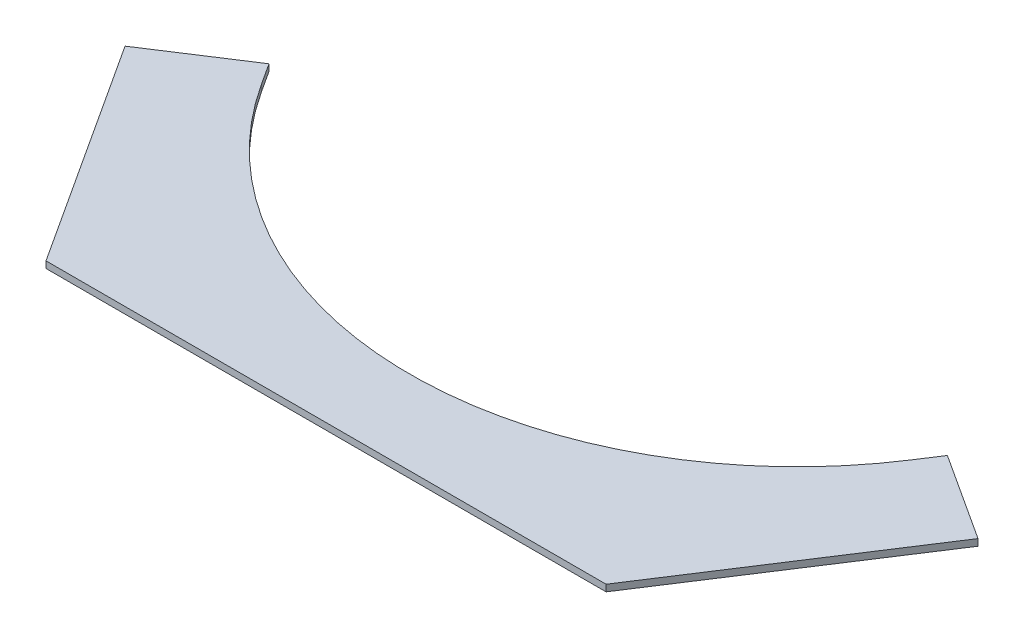
ISO-10303-21;
HEADER;
FILE_DESCRIPTION(('STEP AP214'),'2;1');
FILE_NAME('part.step','',(''),(''),'','','');
FILE_SCHEMA(('AUTOMOTIVE_DESIGN { 1 0 10303 214 1 1 1 1 }'));
ENDSEC;
DATA;
#1=APPLICATION_CONTEXT('core data for automotive mechanical design processes');
#2=APPLICATION_PROTOCOL_DEFINITION('international standard','automotive_design',2000,#1);
#3=PRODUCT_CONTEXT('',#1,'mechanical');
#4=PRODUCT('Part','Part','',(#3));
#5=PRODUCT_RELATED_PRODUCT_CATEGORY('part','',(#4));
#6=PRODUCT_DEFINITION_FORMATION('','',#4);
#7=PRODUCT_DEFINITION_CONTEXT('part definition',#1,'design');
#8=PRODUCT_DEFINITION('design','',#6,#7);
#9=PRODUCT_DEFINITION_SHAPE('','',#8);
#10=(LENGTH_UNIT() NAMED_UNIT(*) SI_UNIT(.MILLI.,.METRE.));
#11=(NAMED_UNIT(*) PLANE_ANGLE_UNIT() SI_UNIT($,.RADIAN.));
#12=(NAMED_UNIT(*) SI_UNIT($,.STERADIAN.) SOLID_ANGLE_UNIT());
#13=UNCERTAINTY_MEASURE_WITH_UNIT(LENGTH_MEASURE(1.E-05),#10,'distance_accuracy_value','');
#14=(GEOMETRIC_REPRESENTATION_CONTEXT(3) GLOBAL_UNCERTAINTY_ASSIGNED_CONTEXT((#13)) GLOBAL_UNIT_ASSIGNED_CONTEXT((#10,
#11,#12)) REPRESENTATION_CONTEXT('',''));
#15=CARTESIAN_POINT('',(0.,0.,0.));
#16=DIRECTION('',(0.,0.,1.));
#17=DIRECTION('',(1.,0.,0.));
#18=AXIS2_PLACEMENT_3D('',#15,#16,#17);
#19=CARTESIAN_POINT('',(-139.851376596993,6.35,-215.352234962946));
#20=DIRECTION('',(0.838670567945421,0.,-0.544639035015032));
#21=DIRECTION('',(-0.544639035015032,0.,-0.838670567945421));
#22=AXIS2_PLACEMENT_3D('',#19,#20,#21);
#23=PLANE('',#22);
#24=DIRECTION('',(0.544639035015032,0.,0.838670567945421));
#25=VECTOR('',#24,1.);
#26=CARTESIAN_POINT('',(-139.851376596993,0.,-215.352234962946));
#27=LINE('',#26,#25);
#28=CARTESIAN_POINT('',(-139.851376596993,0.,-215.352234962946));
#29=VERTEX_POINT('',#28);
#30=CARTESIAN_POINT('',(0.,0.,0.));
#31=VERTEX_POINT('',#30);
#32=EDGE_CURVE('E129',#29,#31,#27,.T.);
#33=ORIENTED_EDGE('',*,*,#32,.T.);
#34=DIRECTION('',(0.,-1.,0.));
#35=VECTOR('',#34,1.);
#36=CARTESIAN_POINT('',(0.,6.35,0.));
#37=LINE('',#36,#35);
#38=CARTESIAN_POINT('',(0.,6.35,0.));
#39=VERTEX_POINT('',#38);
#40=EDGE_CURVE('E11',#39,#31,#37,.T.);
#41=ORIENTED_EDGE('',*,*,#40,.F.);
#42=DIRECTION('',(0.544639035015032,0.,0.838670567945421));
#43=VECTOR('',#42,1.);
#44=CARTESIAN_POINT('',(-139.851376596993,6.35,-215.352234962946));
#45=LINE('',#44,#43);
#46=CARTESIAN_POINT('',(-139.851376596993,6.35,-215.352234962946));
#47=VERTEX_POINT('',#46);
#48=EDGE_CURVE('E143',#47,#39,#45,.T.);
#49=ORIENTED_EDGE('',*,*,#48,.F.);
#50=DIRECTION('',(0.,-1.,0.));
#51=VECTOR('',#50,1.);
#52=CARTESIAN_POINT('',(-139.851376596993,6.35,-215.352234962946));
#53=LINE('',#52,#51);
#54=EDGE_CURVE('E125',#47,#29,#53,.T.);
#55=ORIENTED_EDGE('',*,*,#54,.T.);
#56=EDGE_LOOP('',(#33,#41,#49,#55));
#57=FACE_BOUND('',#56,.T.);
#58=ADVANCED_FACE('F33',(#57),#23,.F.);
#59=CARTESIAN_POINT('',(0.,6.35,0.));
#60=DIRECTION('',(0.,0.,-1.));
#61=DIRECTION('',(-1.,0.,0.));
#62=AXIS2_PLACEMENT_3D('',#59,#60,#61);
#63=PLANE('',#62);
#64=DIRECTION('',(1.,0.,0.));
#65=VECTOR('',#64,1.);
#66=CARTESIAN_POINT('',(0.,0.,0.));
#67=LINE('',#66,#65);
#68=CARTESIAN_POINT('',(534.9068,0.,0.));
#69=VERTEX_POINT('',#68);
#70=EDGE_CURVE('E132',#31,#69,#67,.T.);
#71=ORIENTED_EDGE('',*,*,#70,.T.);
#72=DIRECTION('',(0.,-1.,0.));
#73=VECTOR('',#72,1.);
#74=CARTESIAN_POINT('',(534.9068,6.35,0.));
#75=LINE('',#74,#73);
#76=CARTESIAN_POINT('',(534.9068,6.35,0.));
#77=VERTEX_POINT('',#76);
#78=EDGE_CURVE('E41',#77,#69,#75,.T.);
#79=ORIENTED_EDGE('',*,*,#78,.F.);
#80=DIRECTION('',(1.,0.,0.));
#81=VECTOR('',#80,1.);
#82=CARTESIAN_POINT('',(0.,6.35,0.));
#83=LINE('',#82,#81);
#84=EDGE_CURVE('E92',#39,#77,#83,.T.);
#85=ORIENTED_EDGE('',*,*,#84,.F.);
#86=ORIENTED_EDGE('',*,*,#40,.T.);
#87=EDGE_LOOP('',(#71,#79,#85,#86));
#88=FACE_BOUND('',#87,.T.);
#89=ADVANCED_FACE('F178',(#88),#63,.F.);
#90=CARTESIAN_POINT('',(674.758176596991,6.35,-215.352234962947));
#91=DIRECTION('',(-0.838670567945426,0.,-0.544639035015024));
#92=DIRECTION('',(-0.544639035015024,0.,0.838670567945426));
#93=AXIS2_PLACEMENT_3D('',#90,#91,#92);
#94=PLANE('',#93);
#95=DIRECTION('',(0.544639035015024,0.,-0.838670567945426));
#96=VECTOR('',#95,1.);
#97=CARTESIAN_POINT('',(674.758176596991,0.,-215.352234962947));
#98=LINE('',#97,#96);
#99=CARTESIAN_POINT('',(674.758176596991,0.,-215.352234962947));
#100=VERTEX_POINT('',#99);
#101=EDGE_CURVE('E134',#69,#100,#98,.T.);
#102=ORIENTED_EDGE('',*,*,#101,.T.);
#103=DIRECTION('',(0.,-1.,0.));
#104=VECTOR('',#103,1.);
#105=CARTESIAN_POINT('',(674.758176596991,6.35,-215.352234962947));
#106=LINE('',#105,#104);
#107=CARTESIAN_POINT('',(674.758176596991,6.35,-215.352234962947));
#108=VERTEX_POINT('',#107);
#109=EDGE_CURVE('E150',#108,#100,#106,.T.);
#110=ORIENTED_EDGE('',*,*,#109,.F.);
#111=DIRECTION('',(0.544639035015024,0.,-0.838670567945426));
#112=VECTOR('',#111,1.);
#113=CARTESIAN_POINT('',(674.758176596991,6.35,-215.352234962947));
#114=LINE('',#113,#112);
#115=EDGE_CURVE('E158',#77,#108,#114,.T.);
#116=ORIENTED_EDGE('',*,*,#115,.F.);
#117=ORIENTED_EDGE('',*,*,#78,.T.);
#118=EDGE_LOOP('',(#102,#110,#116,#117));
#119=FACE_BOUND('',#118,.T.);
#120=ADVANCED_FACE('F156',(#119),#94,.F.);
#121=CARTESIAN_POINT('',(674.758176596991,6.35,-215.352234962947));
#122=DIRECTION('',(-0.54463903501503,0.,0.838670567945422));
#123=DIRECTION('',(0.838670567945422,0.,0.54463903501503));
#124=AXIS2_PLACEMENT_3D('',#121,#122,#123);
#125=PLANE('',#124);
#126=DIRECTION('',(-0.838670567945422,0.,-0.54463903501503));
#127=VECTOR('',#126,1.);
#128=CARTESIAN_POINT('',(674.758176596991,0.,-215.352234962947));
#129=LINE('',#128,#127);
#130=CARTESIAN_POINT('',(591.419398393198,0.,-269.473070336294));
#131=VERTEX_POINT('',#130);
#132=EDGE_CURVE('E136',#100,#131,#129,.T.);
#133=ORIENTED_EDGE('',*,*,#132,.T.);
#134=DIRECTION('',(0.,-1.,0.));
#135=VECTOR('',#134,1.);
#136=CARTESIAN_POINT('',(591.419398393198,6.35,-269.473070336294));
#137=LINE('',#136,#135);
#138=CARTESIAN_POINT('',(591.419398393198,6.35,-269.473070336294));
#139=VERTEX_POINT('',#138);
#140=EDGE_CURVE('E147',#139,#131,#137,.T.);
#141=ORIENTED_EDGE('',*,*,#140,.F.);
#142=DIRECTION('',(-0.838670567945422,0.,-0.54463903501503));
#143=VECTOR('',#142,1.);
#144=CARTESIAN_POINT('',(674.758176596991,6.35,-215.352234962947));
#145=LINE('',#144,#143);
#146=EDGE_CURVE('E170',#108,#139,#145,.T.);
#147=ORIENTED_EDGE('',*,*,#146,.F.);
#148=ORIENTED_EDGE('',*,*,#109,.T.);
#149=EDGE_LOOP('',(#133,#141,#147,#148));
#150=FACE_BOUND('',#149,.T.);
#151=ADVANCED_FACE('F166',(#150),#125,.F.);
#152=CARTESIAN_POINT('',(591.419398393198,6.35,-269.473070336294));
#153=DIRECTION('',(0.838670567945427,0.,0.544639035015022));
#154=DIRECTION('',(0.544639035015022,0.,-0.838670567945427));
#155=AXIS2_PLACEMENT_3D('',#152,#153,#154);
#156=PLANE('',#155);
#157=DIRECTION('',(-0.544639035015022,0.,0.838670567945427));
#158=VECTOR('',#157,1.);
#159=CARTESIAN_POINT('',(591.419398393198,0.,-269.473070336294));
#160=LINE('',#159,#158);
#161=CARTESIAN_POINT('',(577.803422517822,0.,-248.506306137658));
#162=VERTEX_POINT('',#161);
#163=EDGE_CURVE('E138',#131,#162,#160,.T.);
#164=ORIENTED_EDGE('',*,*,#163,.T.);
#165=DIRECTION('',(0.,-1.,0.));
#166=VECTOR('',#165,1.);
#167=CARTESIAN_POINT('',(577.803422517822,6.35,-248.506306137658));
#168=LINE('',#167,#166);
#169=CARTESIAN_POINT('',(577.803422517822,6.35,-248.506306137658));
#170=VERTEX_POINT('',#169);
#171=EDGE_CURVE('E120',#170,#162,#168,.T.);
#172=ORIENTED_EDGE('',*,*,#171,.F.);
#173=DIRECTION('',(-0.544639035015022,0.,0.838670567945427));
#174=VECTOR('',#173,1.);
#175=CARTESIAN_POINT('',(591.419398393198,6.35,-269.473070336294));
#176=LINE('',#175,#174);
#177=EDGE_CURVE('E111',#139,#170,#176,.T.);
#178=ORIENTED_EDGE('',*,*,#177,.F.);
#179=ORIENTED_EDGE('',*,*,#140,.T.);
#180=EDGE_LOOP('',(#164,#172,#178,#179));
#181=FACE_BOUND('',#180,.T.);
#182=ADVANCED_FACE('F169',(#181),#156,.F.);
#183=CARTESIAN_POINT('',(267.453399999999,6.35,-450.049967309754));
#184=DIRECTION('',(0.,-1.,0.));
#185=DIRECTION('',(0.,0.,-1.));
#186=AXIS2_PLACEMENT_3D('',#183,#184,#185);
#187=CYLINDRICAL_SURFACE('',#186,370.049974781064);
#188=CARTESIAN_POINT('',(267.453399999999,0.,-450.049967309754));
#189=DIRECTION('',(0.,-1.,0.));
#190=DIRECTION('',(0.,0.,1.));
#191=AXIS2_PLACEMENT_3D('',#188,#189,#190);
#192=CIRCLE('',#191,370.049974781064);
#193=CARTESIAN_POINT('',(-42.8966225178243,0.,-248.506306137658));
#194=VERTEX_POINT('',#193);
#195=EDGE_CURVE('E119',#162,#194,#192,.T.);
#196=ORIENTED_EDGE('',*,*,#195,.T.);
#197=DIRECTION('',(0.,-1.,0.));
#198=VECTOR('',#197,1.);
#199=CARTESIAN_POINT('',(-42.8966225178243,6.35,-248.506306137658));
#200=LINE('',#199,#198);
#201=CARTESIAN_POINT('',(-42.8966225178243,6.35,-248.506306137658));
#202=VERTEX_POINT('',#201);
#203=EDGE_CURVE('E116',#202,#194,#200,.T.);
#204=ORIENTED_EDGE('',*,*,#203,.F.);
#205=CARTESIAN_POINT('',(267.453399999999,6.35,-450.049967309754));
#206=DIRECTION('',(0.,-1.,0.));
#207=DIRECTION('',(0.,0.,1.));
#208=AXIS2_PLACEMENT_3D('',#205,#206,#207);
#209=CIRCLE('',#208,370.049974781064);
#210=EDGE_CURVE('E105',#170,#202,#209,.T.);
#211=ORIENTED_EDGE('',*,*,#210,.F.);
#212=ORIENTED_EDGE('',*,*,#171,.T.);
#213=EDGE_LOOP('',(#196,#204,#211,#212));
#214=FACE_BOUND('',#213,.T.);
#215=ADVANCED_FACE('F117',(#214),#187,.F.);
#216=CARTESIAN_POINT('',(-56.5125983932001,6.35,-269.473070336293));
#217=DIRECTION('',(-0.83867056794542,0.,0.544639035015033));
#218=DIRECTION('',(0.544639035015033,0.,0.83867056794542));
#219=AXIS2_PLACEMENT_3D('',#216,#217,#218);
#220=PLANE('',#219);
#221=DIRECTION('',(-0.544639035015033,0.,-0.83867056794542));
#222=VECTOR('',#221,1.);
#223=CARTESIAN_POINT('',(-56.5125983932001,0.,-269.473070336293));
#224=LINE('',#223,#222);
#225=CARTESIAN_POINT('',(-56.5125983932001,0.,-269.473070336293));
#226=VERTEX_POINT('',#225);
#227=EDGE_CURVE('E78',#194,#226,#224,.T.);
#228=ORIENTED_EDGE('',*,*,#227,.T.);
#229=DIRECTION('',(0.,-1.,0.));
#230=VECTOR('',#229,1.);
#231=CARTESIAN_POINT('',(-56.5125983932001,6.35,-269.473070336293));
#232=LINE('',#231,#230);
#233=CARTESIAN_POINT('',(-56.5125983932001,6.35,-269.473070336293));
#234=VERTEX_POINT('',#233);
#235=EDGE_CURVE('E121',#234,#226,#232,.T.);
#236=ORIENTED_EDGE('',*,*,#235,.F.);
#237=DIRECTION('',(-0.544639035015033,0.,-0.83867056794542));
#238=VECTOR('',#237,1.);
#239=CARTESIAN_POINT('',(-56.5125983932001,6.35,-269.473070336293));
#240=LINE('',#239,#238);
#241=EDGE_CURVE('E109',#202,#234,#240,.T.);
#242=ORIENTED_EDGE('',*,*,#241,.F.);
#243=ORIENTED_EDGE('',*,*,#203,.T.);
#244=EDGE_LOOP('',(#228,#236,#242,#243));
#245=FACE_BOUND('',#244,.T.);
#246=ADVANCED_FACE('F123',(#245),#220,.F.);
#247=CARTESIAN_POINT('',(-139.851376596993,6.35,-215.352234962946));
#248=DIRECTION('',(0.544639035015032,0.,0.83867056794542));
#249=DIRECTION('',(0.838670567945421,0.,-0.544639035015032));
#250=AXIS2_PLACEMENT_3D('',#247,#248,#249);
#251=PLANE('',#250);
#252=DIRECTION('',(-0.838670567945421,0.,0.544639035015032));
#253=VECTOR('',#252,1.);
#254=CARTESIAN_POINT('',(-139.851376596993,0.,-215.352234962946));
#255=LINE('',#254,#253);
#256=EDGE_CURVE('E84',#226,#29,#255,.T.);
#257=ORIENTED_EDGE('',*,*,#256,.T.);
#258=ORIENTED_EDGE('',*,*,#54,.F.);
#259=DIRECTION('',(-0.838670567945421,0.,0.544639035015032));
#260=VECTOR('',#259,1.);
#261=CARTESIAN_POINT('',(-139.851376596993,6.35,-215.352234962946));
#262=LINE('',#261,#260);
#263=EDGE_CURVE('E49',#234,#47,#262,.T.);
#264=ORIENTED_EDGE('',*,*,#263,.F.);
#265=ORIENTED_EDGE('',*,*,#235,.T.);
#266=EDGE_LOOP('',(#257,#258,#264,#265));
#267=FACE_BOUND('',#266,.T.);
#268=ADVANCED_FACE('F194',(#267),#251,.F.);
#269=CARTESIAN_POINT('',(267.453399999999,6.35,-450.049967309754));
#270=DIRECTION('',(0.,1.,0.));
#271=DIRECTION('',(0.,0.,1.));
#272=AXIS2_PLACEMENT_3D('',#269,#270,#271);
#273=PLANE('',#272);
#274=ORIENTED_EDGE('',*,*,#48,.T.);
#275=ORIENTED_EDGE('',*,*,#84,.T.);
#276=ORIENTED_EDGE('',*,*,#115,.T.);
#277=ORIENTED_EDGE('',*,*,#146,.T.);
#278=ORIENTED_EDGE('',*,*,#177,.T.);
#279=ORIENTED_EDGE('',*,*,#210,.T.);
#280=ORIENTED_EDGE('',*,*,#241,.T.);
#281=ORIENTED_EDGE('',*,*,#263,.T.);
#282=EDGE_LOOP('',(#274,#275,#276,#277,#278,#279,#280,#281));
#283=FACE_BOUND('',#282,.T.);
#284=ADVANCED_FACE('F107',(#283),#273,.T.);
#285=CARTESIAN_POINT('',(267.453399999999,0.,-450.049967309754));
#286=DIRECTION('',(0.,1.,0.));
#287=DIRECTION('',(0.,0.,1.));
#288=AXIS2_PLACEMENT_3D('',#285,#286,#287);
#289=PLANE('',#288);
#290=ORIENTED_EDGE('',*,*,#32,.F.);
#291=ORIENTED_EDGE('',*,*,#256,.F.);
#292=ORIENTED_EDGE('',*,*,#227,.F.);
#293=ORIENTED_EDGE('',*,*,#195,.F.);
#294=ORIENTED_EDGE('',*,*,#163,.F.);
#295=ORIENTED_EDGE('',*,*,#132,.F.);
#296=ORIENTED_EDGE('',*,*,#101,.F.);
#297=ORIENTED_EDGE('',*,*,#70,.F.);
#298=EDGE_LOOP('',(#290,#291,#292,#293,#294,#295,#296,#297));
#299=FACE_BOUND('',#298,.T.);
#300=ADVANCED_FACE('F162',(#299),#289,.F.);
#301=CLOSED_SHELL('',(#58,#89,#120,#151,#182,#215,#246,#268,#284,#300));
#302=MANIFOLD_SOLID_BREP('B2',#301);
#303=ADVANCED_BREP_SHAPE_REPRESENTATION('',(#18,#302),#14);
#304=SHAPE_DEFINITION_REPRESENTATION(#9,#303);
ENDSEC;
END-ISO-10303-21;
